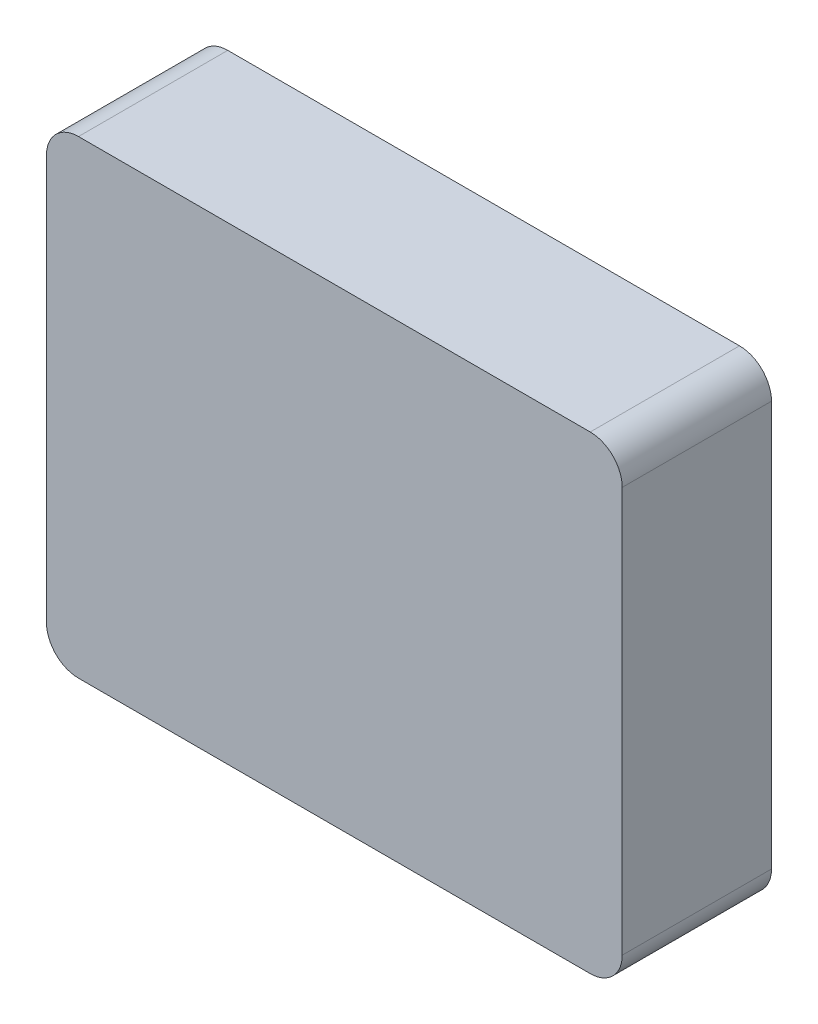
ISO-10303-21;
HEADER;
FILE_DESCRIPTION(('STEP AP214'),'2;1');
FILE_NAME('part.step','',(''),(''),'','','');
FILE_SCHEMA(('AUTOMOTIVE_DESIGN { 1 0 10303 214 1 1 1 1 }'));
ENDSEC;
DATA;
#1=APPLICATION_CONTEXT('core data for automotive mechanical design processes');
#2=APPLICATION_PROTOCOL_DEFINITION('international standard','automotive_design',2000,#1);
#3=PRODUCT_CONTEXT('',#1,'mechanical');
#4=PRODUCT('Part','Part','',(#3));
#5=PRODUCT_RELATED_PRODUCT_CATEGORY('part','',(#4));
#6=PRODUCT_DEFINITION_FORMATION('','',#4);
#7=PRODUCT_DEFINITION_CONTEXT('part definition',#1,'design');
#8=PRODUCT_DEFINITION('design','',#6,#7);
#9=PRODUCT_DEFINITION_SHAPE('','',#8);
#10=(LENGTH_UNIT() NAMED_UNIT(*) SI_UNIT(.MILLI.,.METRE.));
#11=(NAMED_UNIT(*) PLANE_ANGLE_UNIT() SI_UNIT($,.RADIAN.));
#12=(NAMED_UNIT(*) SI_UNIT($,.STERADIAN.) SOLID_ANGLE_UNIT());
#13=UNCERTAINTY_MEASURE_WITH_UNIT(LENGTH_MEASURE(1.E-05),#10,'distance_accuracy_value','');
#14=(GEOMETRIC_REPRESENTATION_CONTEXT(3) GLOBAL_UNCERTAINTY_ASSIGNED_CONTEXT((#13)) GLOBAL_UNIT_ASSIGNED_CONTEXT((#10,
#11,#12)) REPRESENTATION_CONTEXT('',''));
#15=CARTESIAN_POINT('',(0.,0.,0.));
#16=DIRECTION('',(0.,0.,1.));
#17=DIRECTION('',(1.,0.,0.));
#18=AXIS2_PLACEMENT_3D('',#15,#16,#17);
#19=CARTESIAN_POINT('',(0.,0.,0.));
#20=DIRECTION('',(0.,0.,1.));
#21=DIRECTION('',(1.,0.,0.));
#22=AXIS2_PLACEMENT_3D('',#19,#20,#21);
#23=PLANE('',#22);
#24=CARTESIAN_POINT('',(12.,9.5,0.));
#25=DIRECTION('',(0.,0.,1.));
#26=DIRECTION('',(1.,0.,0.));
#27=AXIS2_PLACEMENT_3D('',#24,#25,#26);
#28=CIRCLE('',#27,1.5);
#29=CARTESIAN_POINT('',(12.,11.,0.));
#30=VERTEX_POINT('',#29);
#31=CARTESIAN_POINT('',(13.5,9.5,0.));
#32=VERTEX_POINT('',#31);
#33=EDGE_CURVE('E35',#30,#32,#28,.F.);
#34=ORIENTED_EDGE('',*,*,#33,.T.);
#35=DIRECTION('',(0.,1.,0.));
#36=VECTOR('',#35,1.);
#37=CARTESIAN_POINT('',(13.5,11.,0.));
#38=LINE('',#37,#36);
#39=CARTESIAN_POINT('',(13.5,-9.5,0.));
#40=VERTEX_POINT('',#39);
#41=EDGE_CURVE('E202',#40,#32,#38,.T.);
#42=ORIENTED_EDGE('',*,*,#41,.F.);
#43=CARTESIAN_POINT('',(12.,-9.5,0.));
#44=DIRECTION('',(0.,0.,1.));
#45=DIRECTION('',(1.,0.,0.));
#46=AXIS2_PLACEMENT_3D('',#43,#44,#45);
#47=CIRCLE('',#46,1.5);
#48=CARTESIAN_POINT('',(12.,-11.,0.));
#49=VERTEX_POINT('',#48);
#50=EDGE_CURVE('E198',#40,#49,#47,.F.);
#51=ORIENTED_EDGE('',*,*,#50,.T.);
#52=DIRECTION('',(1.,0.,0.));
#53=VECTOR('',#52,1.);
#54=CARTESIAN_POINT('',(13.5,-11.,0.));
#55=LINE('',#54,#53);
#56=CARTESIAN_POINT('',(-12.,-11.,0.));
#57=VERTEX_POINT('',#56);
#58=EDGE_CURVE('E199',#57,#49,#55,.T.);
#59=ORIENTED_EDGE('',*,*,#58,.F.);
#60=CARTESIAN_POINT('',(-12.,-9.5,0.));
#61=DIRECTION('',(0.,0.,1.));
#62=DIRECTION('',(1.,0.,0.));
#63=AXIS2_PLACEMENT_3D('',#60,#61,#62);
#64=CIRCLE('',#63,1.5);
#65=CARTESIAN_POINT('',(-13.5,-9.5,0.));
#66=VERTEX_POINT('',#65);
#67=EDGE_CURVE('E195',#57,#66,#64,.F.);
#68=ORIENTED_EDGE('',*,*,#67,.T.);
#69=DIRECTION('',(0.,-1.,0.));
#70=VECTOR('',#69,1.);
#71=CARTESIAN_POINT('',(-13.5,11.,0.));
#72=LINE('',#71,#70);
#73=CARTESIAN_POINT('',(-13.5,9.5,0.));
#74=VERTEX_POINT('',#73);
#75=EDGE_CURVE('E201',#74,#66,#72,.T.);
#76=ORIENTED_EDGE('',*,*,#75,.F.);
#77=CARTESIAN_POINT('',(-12.,9.5,0.));
#78=DIRECTION('',(0.,0.,1.));
#79=DIRECTION('',(1.,0.,0.));
#80=AXIS2_PLACEMENT_3D('',#77,#78,#79);
#81=CIRCLE('',#80,1.5);
#82=CARTESIAN_POINT('',(-12.,11.,0.));
#83=VERTEX_POINT('',#82);
#84=EDGE_CURVE('E143',#74,#83,#81,.F.);
#85=ORIENTED_EDGE('',*,*,#84,.T.);
#86=DIRECTION('',(-1.,0.,0.));
#87=VECTOR('',#86,1.);
#88=CARTESIAN_POINT('',(13.5,11.,0.));
#89=LINE('',#88,#87);
#90=EDGE_CURVE('E172',#30,#83,#89,.T.);
#91=ORIENTED_EDGE('',*,*,#90,.F.);
#92=EDGE_LOOP('',(#34,#42,#51,#59,#68,#76,#85,#91));
#93=FACE_BOUND('',#92,.T.);
#94=DIRECTION('',(0.,-1.,0.));
#95=VECTOR('',#94,1.);
#96=CARTESIAN_POINT('',(-11.3,11.,0.));
#97=LINE('',#96,#95);
#98=CARTESIAN_POINT('',(-11.3,8.8,0.));
#99=VERTEX_POINT('',#98);
#100=CARTESIAN_POINT('',(-11.3,-8.8,0.));
#101=VERTEX_POINT('',#100);
#102=EDGE_CURVE('E193',#99,#101,#97,.T.);
#103=ORIENTED_EDGE('',*,*,#102,.T.);
#104=DIRECTION('',(1.,0.,0.));
#105=VECTOR('',#104,1.);
#106=CARTESIAN_POINT('',(13.5,-8.8,0.));
#107=LINE('',#106,#105);
#108=CARTESIAN_POINT('',(11.3,-8.8,0.));
#109=VERTEX_POINT('',#108);
#110=EDGE_CURVE('E190',#101,#109,#107,.T.);
#111=ORIENTED_EDGE('',*,*,#110,.T.);
#112=DIRECTION('',(0.,1.,0.));
#113=VECTOR('',#112,1.);
#114=CARTESIAN_POINT('',(11.3,11.,0.));
#115=LINE('',#114,#113);
#116=CARTESIAN_POINT('',(11.3,8.8,0.));
#117=VERTEX_POINT('',#116);
#118=EDGE_CURVE('E40',#109,#117,#115,.T.);
#119=ORIENTED_EDGE('',*,*,#118,.T.);
#120=DIRECTION('',(-1.,0.,0.));
#121=VECTOR('',#120,1.);
#122=CARTESIAN_POINT('',(13.5,8.8,0.));
#123=LINE('',#122,#121);
#124=EDGE_CURVE('E11',#117,#99,#123,.T.);
#125=ORIENTED_EDGE('',*,*,#124,.T.);
#126=EDGE_LOOP('',(#103,#111,#119,#125));
#127=FACE_BOUND('',#126,.T.);
#128=ADVANCED_FACE('F32',(#93,#127),#23,.F.);
#129=CARTESIAN_POINT('',(-11.3,11.,7.));
#130=DIRECTION('',(1.,0.,0.));
#131=DIRECTION('',(0.,1.,0.));
#132=AXIS2_PLACEMENT_3D('',#129,#130,#131);
#133=PLANE('',#132);
#134=ORIENTED_EDGE('',*,*,#102,.F.);
#135=DIRECTION('',(0.,0.,1.));
#136=VECTOR('',#135,1.);
#137=CARTESIAN_POINT('',(-11.3,8.8,7.));
#138=LINE('',#137,#136);
#139=CARTESIAN_POINT('',(-11.3,8.8,4.8));
#140=VERTEX_POINT('',#139);
#141=EDGE_CURVE('E182',#99,#140,#138,.T.);
#142=ORIENTED_EDGE('',*,*,#141,.T.);
#143=DIRECTION('',(0.,-1.,0.));
#144=VECTOR('',#143,1.);
#145=CARTESIAN_POINT('',(-11.3,0.,4.8));
#146=LINE('',#145,#144);
#147=CARTESIAN_POINT('',(-11.3,-8.8,4.8));
#148=VERTEX_POINT('',#147);
#149=EDGE_CURVE('E176',#140,#148,#146,.T.);
#150=ORIENTED_EDGE('',*,*,#149,.T.);
#151=DIRECTION('',(0.,0.,1.));
#152=VECTOR('',#151,1.);
#153=CARTESIAN_POINT('',(-11.3,-8.8,7.));
#154=LINE('',#153,#152);
#155=EDGE_CURVE('E168',#101,#148,#154,.T.);
#156=ORIENTED_EDGE('',*,*,#155,.F.);
#157=EDGE_LOOP('',(#134,#142,#150,#156));
#158=FACE_BOUND('',#157,.T.);
#159=ADVANCED_FACE('F246',(#158),#133,.T.);
#160=CARTESIAN_POINT('',(13.5,-8.8,7.));
#161=DIRECTION('',(0.,1.,0.));
#162=DIRECTION('',(-1.,0.,0.));
#163=AXIS2_PLACEMENT_3D('',#160,#161,#162);
#164=PLANE('',#163);
#165=ORIENTED_EDGE('',*,*,#110,.F.);
#166=ORIENTED_EDGE('',*,*,#155,.T.);
#167=DIRECTION('',(1.,0.,0.));
#168=VECTOR('',#167,1.);
#169=CARTESIAN_POINT('',(0.,-8.8,4.8));
#170=LINE('',#169,#168);
#171=CARTESIAN_POINT('',(11.3,-8.8,4.8));
#172=VERTEX_POINT('',#171);
#173=EDGE_CURVE('E173',#148,#172,#170,.T.);
#174=ORIENTED_EDGE('',*,*,#173,.T.);
#175=DIRECTION('',(0.,0.,1.));
#176=VECTOR('',#175,1.);
#177=CARTESIAN_POINT('',(11.3,-8.8,7.));
#178=LINE('',#177,#176);
#179=EDGE_CURVE('E186',#109,#172,#178,.T.);
#180=ORIENTED_EDGE('',*,*,#179,.F.);
#181=EDGE_LOOP('',(#165,#166,#174,#180));
#182=FACE_BOUND('',#181,.T.);
#183=ADVANCED_FACE('F250',(#182),#164,.T.);
#184=CARTESIAN_POINT('',(11.3,11.,7.));
#185=DIRECTION('',(-1.,0.,0.));
#186=DIRECTION('',(0.,-1.,0.));
#187=AXIS2_PLACEMENT_3D('',#184,#185,#186);
#188=PLANE('',#187);
#189=ORIENTED_EDGE('',*,*,#118,.F.);
#190=ORIENTED_EDGE('',*,*,#179,.T.);
#191=DIRECTION('',(0.,1.,0.));
#192=VECTOR('',#191,1.);
#193=CARTESIAN_POINT('',(11.3,0.,4.8));
#194=LINE('',#193,#192);
#195=CARTESIAN_POINT('',(11.3,8.8,4.8));
#196=VERTEX_POINT('',#195);
#197=EDGE_CURVE('E169',#172,#196,#194,.T.);
#198=ORIENTED_EDGE('',*,*,#197,.T.);
#199=DIRECTION('',(0.,0.,1.));
#200=VECTOR('',#199,1.);
#201=CARTESIAN_POINT('',(11.3,8.8,7.));
#202=LINE('',#201,#200);
#203=EDGE_CURVE('E184',#117,#196,#202,.T.);
#204=ORIENTED_EDGE('',*,*,#203,.F.);
#205=EDGE_LOOP('',(#189,#190,#198,#204));
#206=FACE_BOUND('',#205,.T.);
#207=ADVANCED_FACE('F255',(#206),#188,.T.);
#208=CARTESIAN_POINT('',(13.5,8.8,7.));
#209=DIRECTION('',(0.,-1.,0.));
#210=DIRECTION('',(1.,0.,0.));
#211=AXIS2_PLACEMENT_3D('',#208,#209,#210);
#212=PLANE('',#211);
#213=ORIENTED_EDGE('',*,*,#124,.F.);
#214=ORIENTED_EDGE('',*,*,#203,.T.);
#215=DIRECTION('',(-1.,0.,0.));
#216=VECTOR('',#215,1.);
#217=CARTESIAN_POINT('',(0.,8.8,4.8));
#218=LINE('',#217,#216);
#219=EDGE_CURVE('E179',#196,#140,#218,.T.);
#220=ORIENTED_EDGE('',*,*,#219,.T.);
#221=ORIENTED_EDGE('',*,*,#141,.F.);
#222=EDGE_LOOP('',(#213,#214,#220,#221));
#223=FACE_BOUND('',#222,.T.);
#224=ADVANCED_FACE('F261',(#223),#212,.T.);
#225=CARTESIAN_POINT('',(0.,0.,4.8));
#226=DIRECTION('',(0.,0.,-1.));
#227=DIRECTION('',(-1.,0.,0.));
#228=AXIS2_PLACEMENT_3D('',#225,#226,#227);
#229=PLANE('',#228);
#230=ORIENTED_EDGE('',*,*,#219,.F.);
#231=ORIENTED_EDGE('',*,*,#197,.F.);
#232=ORIENTED_EDGE('',*,*,#173,.F.);
#233=ORIENTED_EDGE('',*,*,#149,.F.);
#234=EDGE_LOOP('',(#230,#231,#232,#233));
#235=FACE_BOUND('',#234,.T.);
#236=ADVANCED_FACE('F264',(#235),#229,.T.);
#237=CARTESIAN_POINT('',(-13.5,11.,7.));
#238=DIRECTION('',(1.,0.,0.));
#239=DIRECTION('',(0.,1.,0.));
#240=AXIS2_PLACEMENT_3D('',#237,#238,#239);
#241=PLANE('',#240);
#242=DIRECTION('',(0.,0.,-1.));
#243=VECTOR('',#242,1.);
#244=CARTESIAN_POINT('',(-13.5,9.5,7.));
#245=LINE('',#244,#243);
#246=CARTESIAN_POINT('',(-13.5,9.5,7.));
#247=VERTEX_POINT('',#246);
#248=EDGE_CURVE('E136',#247,#74,#245,.T.);
#249=ORIENTED_EDGE('',*,*,#248,.T.);
#250=ORIENTED_EDGE('',*,*,#75,.T.);
#251=DIRECTION('',(0.,0.,-1.));
#252=VECTOR('',#251,1.);
#253=CARTESIAN_POINT('',(-13.5,-9.5,7.));
#254=LINE('',#253,#252);
#255=CARTESIAN_POINT('',(-13.5,-9.5,7.));
#256=VERTEX_POINT('',#255);
#257=EDGE_CURVE('E138',#66,#256,#254,.F.);
#258=ORIENTED_EDGE('',*,*,#257,.T.);
#259=DIRECTION('',(0.,-1.,0.));
#260=VECTOR('',#259,1.);
#261=CARTESIAN_POINT('',(-13.5,11.,7.));
#262=LINE('',#261,#260);
#263=EDGE_CURVE('E123',#247,#256,#262,.T.);
#264=ORIENTED_EDGE('',*,*,#263,.F.);
#265=EDGE_LOOP('',(#249,#250,#258,#264));
#266=FACE_BOUND('',#265,.T.);
#267=ADVANCED_FACE('F135',(#266),#241,.F.);
#268=CARTESIAN_POINT('',(13.5,-11.,7.));
#269=DIRECTION('',(0.,1.,0.));
#270=DIRECTION('',(-1.,0.,0.));
#271=AXIS2_PLACEMENT_3D('',#268,#269,#270);
#272=PLANE('',#271);
#273=DIRECTION('',(0.,0.,-1.));
#274=VECTOR('',#273,1.);
#275=CARTESIAN_POINT('',(-12.,-11.,7.));
#276=LINE('',#275,#274);
#277=CARTESIAN_POINT('',(-12.,-11.,7.));
#278=VERTEX_POINT('',#277);
#279=EDGE_CURVE('E163',#278,#57,#276,.T.);
#280=ORIENTED_EDGE('',*,*,#279,.T.);
#281=ORIENTED_EDGE('',*,*,#58,.T.);
#282=DIRECTION('',(0.,0.,-1.));
#283=VECTOR('',#282,1.);
#284=CARTESIAN_POINT('',(12.,-11.,7.));
#285=LINE('',#284,#283);
#286=CARTESIAN_POINT('',(12.,-11.,7.));
#287=VERTEX_POINT('',#286);
#288=EDGE_CURVE('E166',#49,#287,#285,.F.);
#289=ORIENTED_EDGE('',*,*,#288,.T.);
#290=DIRECTION('',(1.,0.,0.));
#291=VECTOR('',#290,1.);
#292=CARTESIAN_POINT('',(13.5,-11.,7.));
#293=LINE('',#292,#291);
#294=EDGE_CURVE('E139',#278,#287,#293,.T.);
#295=ORIENTED_EDGE('',*,*,#294,.F.);
#296=EDGE_LOOP('',(#280,#281,#289,#295));
#297=FACE_BOUND('',#296,.T.);
#298=ADVANCED_FACE('F235',(#297),#272,.F.);
#299=CARTESIAN_POINT('',(13.5,11.,7.));
#300=DIRECTION('',(-1.,0.,0.));
#301=DIRECTION('',(0.,-1.,0.));
#302=AXIS2_PLACEMENT_3D('',#299,#300,#301);
#303=PLANE('',#302);
#304=DIRECTION('',(0.,0.,-1.));
#305=VECTOR('',#304,1.);
#306=CARTESIAN_POINT('',(13.5,-9.5,7.));
#307=LINE('',#306,#305);
#308=CARTESIAN_POINT('',(13.5,-9.5,7.));
#309=VERTEX_POINT('',#308);
#310=EDGE_CURVE('E130',#309,#40,#307,.T.);
#311=ORIENTED_EDGE('',*,*,#310,.T.);
#312=ORIENTED_EDGE('',*,*,#41,.T.);
#313=DIRECTION('',(0.,0.,-1.));
#314=VECTOR('',#313,1.);
#315=CARTESIAN_POINT('',(13.5,9.5,7.));
#316=LINE('',#315,#314);
#317=CARTESIAN_POINT('',(13.5,9.5,7.));
#318=VERTEX_POINT('',#317);
#319=EDGE_CURVE('E161',#32,#318,#316,.F.);
#320=ORIENTED_EDGE('',*,*,#319,.T.);
#321=DIRECTION('',(0.,1.,0.));
#322=VECTOR('',#321,1.);
#323=CARTESIAN_POINT('',(13.5,11.,7.));
#324=LINE('',#323,#322);
#325=EDGE_CURVE('E221',#309,#318,#324,.T.);
#326=ORIENTED_EDGE('',*,*,#325,.F.);
#327=EDGE_LOOP('',(#311,#312,#320,#326));
#328=FACE_BOUND('',#327,.T.);
#329=ADVANCED_FACE('F210',(#328),#303,.F.);
#330=CARTESIAN_POINT('',(13.5,11.,7.));
#331=DIRECTION('',(0.,-1.,0.));
#332=DIRECTION('',(1.,0.,0.));
#333=AXIS2_PLACEMENT_3D('',#330,#331,#332);
#334=PLANE('',#333);
#335=DIRECTION('',(0.,0.,-1.));
#336=VECTOR('',#335,1.);
#337=CARTESIAN_POINT('',(12.,11.,7.));
#338=LINE('',#337,#336);
#339=CARTESIAN_POINT('',(12.,11.,7.));
#340=VERTEX_POINT('',#339);
#341=EDGE_CURVE('E145',#340,#30,#338,.T.);
#342=ORIENTED_EDGE('',*,*,#341,.T.);
#343=ORIENTED_EDGE('',*,*,#90,.T.);
#344=DIRECTION('',(0.,0.,-1.));
#345=VECTOR('',#344,1.);
#346=CARTESIAN_POINT('',(-12.,11.,7.));
#347=LINE('',#346,#345);
#348=CARTESIAN_POINT('',(-12.,11.,7.));
#349=VERTEX_POINT('',#348);
#350=EDGE_CURVE('E148',#83,#349,#347,.F.);
#351=ORIENTED_EDGE('',*,*,#350,.T.);
#352=DIRECTION('',(-1.,0.,0.));
#353=VECTOR('',#352,1.);
#354=CARTESIAN_POINT('',(13.5,11.,7.));
#355=LINE('',#354,#353);
#356=EDGE_CURVE('E126',#340,#349,#355,.T.);
#357=ORIENTED_EDGE('',*,*,#356,.F.);
#358=EDGE_LOOP('',(#342,#343,#351,#357));
#359=FACE_BOUND('',#358,.T.);
#360=ADVANCED_FACE('F223',(#359),#334,.F.);
#361=CARTESIAN_POINT('',(0.,0.,7.));
#362=DIRECTION('',(0.,0.,-1.));
#363=DIRECTION('',(-1.,0.,0.));
#364=AXIS2_PLACEMENT_3D('',#361,#362,#363);
#365=PLANE('',#364);
#366=ORIENTED_EDGE('',*,*,#356,.T.);
#367=CARTESIAN_POINT('',(-12.,9.5,7.));
#368=DIRECTION('',(0.,0.,-1.));
#369=DIRECTION('',(-1.,0.,0.));
#370=AXIS2_PLACEMENT_3D('',#367,#368,#369);
#371=CIRCLE('',#370,1.5);
#372=EDGE_CURVE('E120',#349,#247,#371,.F.);
#373=ORIENTED_EDGE('',*,*,#372,.T.);
#374=ORIENTED_EDGE('',*,*,#263,.T.);
#375=CARTESIAN_POINT('',(-12.,-9.5,7.));
#376=DIRECTION('',(0.,0.,-1.));
#377=DIRECTION('',(-1.,0.,0.));
#378=AXIS2_PLACEMENT_3D('',#375,#376,#377);
#379=CIRCLE('',#378,1.5);
#380=EDGE_CURVE('E154',#256,#278,#379,.F.);
#381=ORIENTED_EDGE('',*,*,#380,.T.);
#382=ORIENTED_EDGE('',*,*,#294,.T.);
#383=CARTESIAN_POINT('',(12.,-9.5,7.));
#384=DIRECTION('',(0.,0.,-1.));
#385=DIRECTION('',(-1.,0.,0.));
#386=AXIS2_PLACEMENT_3D('',#383,#384,#385);
#387=CIRCLE('',#386,1.5);
#388=EDGE_CURVE('E156',#287,#309,#387,.F.);
#389=ORIENTED_EDGE('',*,*,#388,.T.);
#390=ORIENTED_EDGE('',*,*,#325,.T.);
#391=CARTESIAN_POINT('',(12.,9.5,7.));
#392=DIRECTION('',(0.,0.,-1.));
#393=DIRECTION('',(-1.,0.,0.));
#394=AXIS2_PLACEMENT_3D('',#391,#392,#393);
#395=CIRCLE('',#394,1.5);
#396=EDGE_CURVE('E131',#318,#340,#395,.F.);
#397=ORIENTED_EDGE('',*,*,#396,.T.);
#398=EDGE_LOOP('',(#366,#373,#374,#381,#382,#389,#390,#397));
#399=FACE_BOUND('',#398,.T.);
#400=ADVANCED_FACE('F122',(#399),#365,.F.);
#401=CARTESIAN_POINT('',(-12.,9.5,7.));
#402=DIRECTION('',(0.,0.,-1.));
#403=DIRECTION('',(-1.,0.,0.));
#404=AXIS2_PLACEMENT_3D('',#401,#402,#403);
#405=CYLINDRICAL_SURFACE('',#404,1.5);
#406=ORIENTED_EDGE('',*,*,#84,.F.);
#407=ORIENTED_EDGE('',*,*,#248,.F.);
#408=ORIENTED_EDGE('',*,*,#372,.F.);
#409=ORIENTED_EDGE('',*,*,#350,.F.);
#410=EDGE_LOOP('',(#406,#407,#408,#409));
#411=FACE_BOUND('',#410,.T.);
#412=ADVANCED_FACE('F141',(#411),#405,.T.);
#413=CARTESIAN_POINT('',(12.,9.5,7.));
#414=DIRECTION('',(0.,0.,-1.));
#415=DIRECTION('',(-1.,0.,0.));
#416=AXIS2_PLACEMENT_3D('',#413,#414,#415);
#417=CYLINDRICAL_SURFACE('',#416,1.5);
#418=ORIENTED_EDGE('',*,*,#33,.F.);
#419=ORIENTED_EDGE('',*,*,#341,.F.);
#420=ORIENTED_EDGE('',*,*,#396,.F.);
#421=ORIENTED_EDGE('',*,*,#319,.F.);
#422=EDGE_LOOP('',(#418,#419,#420,#421));
#423=FACE_BOUND('',#422,.T.);
#424=ADVANCED_FACE('F220',(#423),#417,.T.);
#425=CARTESIAN_POINT('',(12.,-9.5,7.));
#426=DIRECTION('',(0.,0.,-1.));
#427=DIRECTION('',(-1.,0.,0.));
#428=AXIS2_PLACEMENT_3D('',#425,#426,#427);
#429=CYLINDRICAL_SURFACE('',#428,1.5);
#430=ORIENTED_EDGE('',*,*,#50,.F.);
#431=ORIENTED_EDGE('',*,*,#310,.F.);
#432=ORIENTED_EDGE('',*,*,#388,.F.);
#433=ORIENTED_EDGE('',*,*,#288,.F.);
#434=EDGE_LOOP('',(#430,#431,#432,#433));
#435=FACE_BOUND('',#434,.T.);
#436=ADVANCED_FACE('F233',(#435),#429,.T.);
#437=CARTESIAN_POINT('',(-12.,-9.5,7.));
#438=DIRECTION('',(0.,0.,-1.));
#439=DIRECTION('',(-1.,0.,0.));
#440=AXIS2_PLACEMENT_3D('',#437,#438,#439);
#441=CYLINDRICAL_SURFACE('',#440,1.5);
#442=ORIENTED_EDGE('',*,*,#67,.F.);
#443=ORIENTED_EDGE('',*,*,#279,.F.);
#444=ORIENTED_EDGE('',*,*,#380,.F.);
#445=ORIENTED_EDGE('',*,*,#257,.F.);
#446=EDGE_LOOP('',(#442,#443,#444,#445));
#447=FACE_BOUND('',#446,.T.);
#448=ADVANCED_FACE('F237',(#447),#441,.T.);
#449=CLOSED_SHELL('',(#128,#159,#183,#207,#224,#236,#267,#298,#329,#360,#400,#412,#424,#436,#448));
#450=MANIFOLD_SOLID_BREP('B2',#449);
#451=ADVANCED_BREP_SHAPE_REPRESENTATION('',(#18,#450),#14);
#452=SHAPE_DEFINITION_REPRESENTATION(#9,#451);
ENDSEC;
END-ISO-10303-21;
